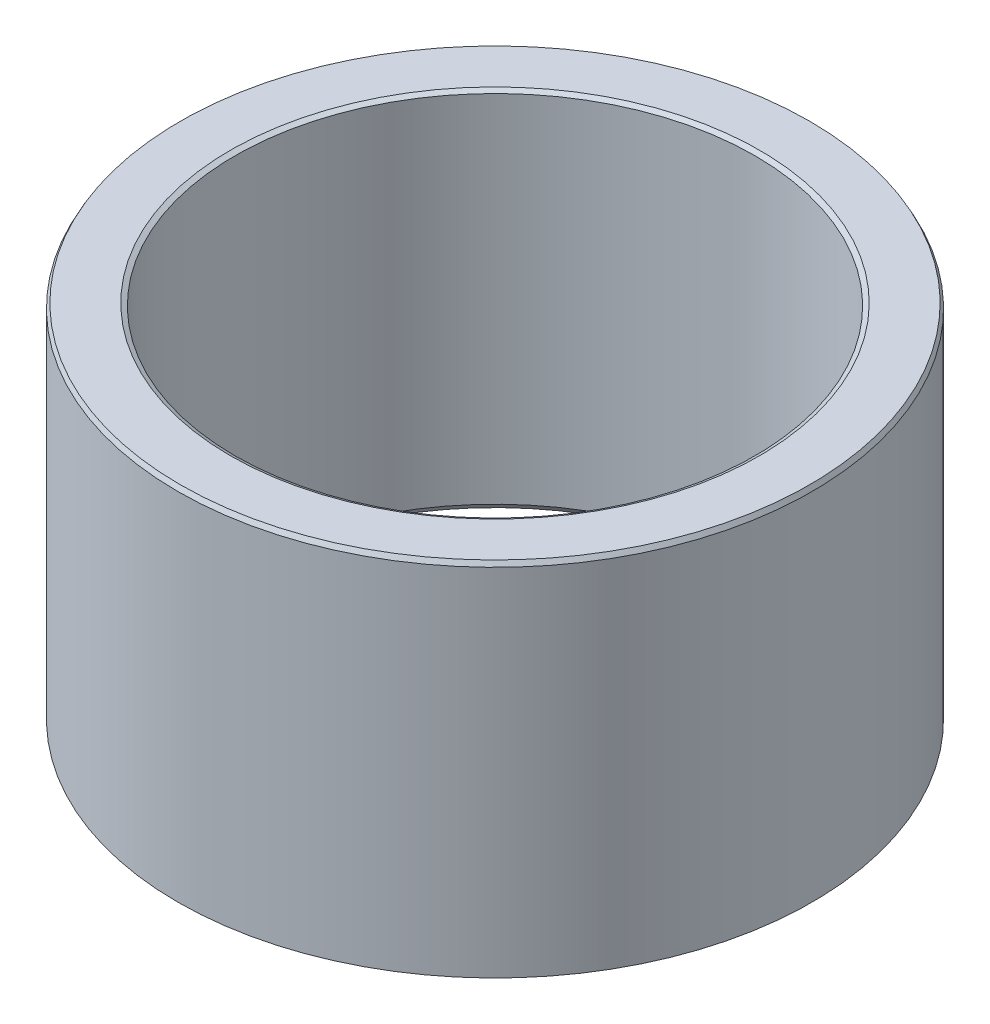
ISO-10303-21;
HEADER;
FILE_DESCRIPTION(('STEP AP214'),'2;1');
FILE_NAME('part.step','',(''),(''),'','','');
FILE_SCHEMA(('AUTOMOTIVE_DESIGN { 1 0 10303 214 1 1 1 1 }'));
ENDSEC;
DATA;
#1=APPLICATION_CONTEXT('core data for automotive mechanical design processes');
#2=APPLICATION_PROTOCOL_DEFINITION('international standard','automotive_design',2000,#1);
#3=PRODUCT_CONTEXT('',#1,'mechanical');
#4=PRODUCT('Part','Part','',(#3));
#5=PRODUCT_RELATED_PRODUCT_CATEGORY('part','',(#4));
#6=PRODUCT_DEFINITION_FORMATION('','',#4);
#7=PRODUCT_DEFINITION_CONTEXT('part definition',#1,'design');
#8=PRODUCT_DEFINITION('design','',#6,#7);
#9=PRODUCT_DEFINITION_SHAPE('','',#8);
#10=(LENGTH_UNIT() NAMED_UNIT(*) SI_UNIT(.MILLI.,.METRE.));
#11=(NAMED_UNIT(*) PLANE_ANGLE_UNIT() SI_UNIT($,.RADIAN.));
#12=(NAMED_UNIT(*) SI_UNIT($,.STERADIAN.) SOLID_ANGLE_UNIT());
#13=UNCERTAINTY_MEASURE_WITH_UNIT(LENGTH_MEASURE(1.E-05),#10,'distance_accuracy_value','');
#14=(GEOMETRIC_REPRESENTATION_CONTEXT(3) GLOBAL_UNCERTAINTY_ASSIGNED_CONTEXT((#13)) GLOBAL_UNIT_ASSIGNED_CONTEXT((#10,
#11,#12)) REPRESENTATION_CONTEXT('',''));
#15=CARTESIAN_POINT('',(0.,0.,0.));
#16=DIRECTION('',(0.,0.,1.));
#17=DIRECTION('',(1.,0.,0.));
#18=AXIS2_PLACEMENT_3D('',#15,#16,#17);
#19=CARTESIAN_POINT('',(0.,40.0247084313328,0.));
#20=DIRECTION('',(0.,-1.,0.));
#21=DIRECTION('',(0.,0.,-1.));
#22=AXIS2_PLACEMENT_3D('',#19,#20,#21);
#23=CYLINDRICAL_SURFACE('',#22,35.);
#24=CARTESIAN_POINT('',(0.,0.266962145229234,0.));
#25=DIRECTION('',(0.,1.,0.));
#26=DIRECTION('',(0.,0.,1.));
#27=AXIS2_PLACEMENT_3D('',#24,#25,#26);
#28=CIRCLE('',#27,35.);
#29=CARTESIAN_POINT('',(0.,0.266962145229234,35.));
#30=VERTEX_POINT('',#29);
#31=EDGE_CURVE('E10',#30,#30,#28,.T.);
#32=ORIENTED_EDGE('',*,*,#31,.T.);
#33=EDGE_LOOP('',(#32));
#34=FACE_BOUND('',#33,.T.);
#35=CARTESIAN_POINT('',(0.,39.5119294516026,0.));
#36=DIRECTION('',(0.,1.,0.));
#37=DIRECTION('',(0.,0.,1.));
#38=AXIS2_PLACEMENT_3D('',#35,#36,#37);
#39=CIRCLE('',#38,35.);
#40=CARTESIAN_POINT('',(0.,39.5119294516026,35.));
#41=VERTEX_POINT('',#40);
#42=EDGE_CURVE('E50',#41,#41,#39,.F.);
#43=ORIENTED_EDGE('',*,*,#42,.T.);
#44=EDGE_LOOP('',(#43));
#45=FACE_BOUND('',#44,.T.);
#46=ADVANCED_FACE('F39',(#34,#45),#23,.T.);
#47=CARTESIAN_POINT('',(0.,40.0247084313328,0.));
#48=DIRECTION('',(0.,1.,0.));
#49=DIRECTION('',(0.,0.,1.));
#50=AXIS2_PLACEMENT_3D('',#47,#48,#49);
#51=PLANE('',#50);
#52=CARTESIAN_POINT('',(0.,40.0247084313328,0.));
#53=DIRECTION('',(0.,1.,0.));
#54=DIRECTION('',(0.,0.,1.));
#55=AXIS2_PLACEMENT_3D('',#52,#53,#54);
#56=CIRCLE('',#55,29.1983333612217);
#57=CARTESIAN_POINT('',(0.,40.0247084313328,29.1983333612217));
#58=VERTEX_POINT('',#57);
#59=EDGE_CURVE('E58',#58,#58,#56,.F.);
#60=ORIENTED_EDGE('',*,*,#59,.T.);
#61=EDGE_LOOP('',(#60));
#62=FACE_BOUND('',#61,.T.);
#63=CARTESIAN_POINT('',(0.,40.0247084313328,0.));
#64=DIRECTION('',(0.,1.,0.));
#65=DIRECTION('',(0.,0.,1.));
#66=AXIS2_PLACEMENT_3D('',#63,#64,#65);
#67=CIRCLE('',#66,34.7330378547708);
#68=CARTESIAN_POINT('',(0.,40.0247084313328,34.7330378547708));
#69=VERTEX_POINT('',#68);
#70=EDGE_CURVE('E61',#69,#69,#67,.T.);
#71=ORIENTED_EDGE('',*,*,#70,.T.);
#72=EDGE_LOOP('',(#71));
#73=FACE_BOUND('',#72,.T.);
#74=ADVANCED_FACE('F88',(#62,#73),#51,.T.);
#75=CARTESIAN_POINT('',(0.,0.,0.));
#76=DIRECTION('',(0.,1.,0.));
#77=DIRECTION('',(0.,0.,1.));
#78=AXIS2_PLACEMENT_3D('',#75,#76,#77);
#79=PLANE('',#78);
#80=CARTESIAN_POINT('',(0.,0.,0.));
#81=DIRECTION('',(0.,1.,0.));
#82=DIRECTION('',(0.,0.,1.));
#83=AXIS2_PLACEMENT_3D('',#80,#81,#82);
#84=CIRCLE('',#83,28.9525165267208);
#85=CARTESIAN_POINT('',(0.,0.,28.9525165267208));
#86=VERTEX_POINT('',#85);
#87=EDGE_CURVE('E51',#86,#86,#84,.T.);
#88=ORIENTED_EDGE('',*,*,#87,.T.);
#89=EDGE_LOOP('',(#88));
#90=FACE_BOUND('',#89,.T.);
#91=CARTESIAN_POINT('',(0.,0.,0.));
#92=DIRECTION('',(0.,1.,0.));
#93=DIRECTION('',(0.,0.,1.));
#94=AXIS2_PLACEMENT_3D('',#91,#92,#93);
#95=CIRCLE('',#94,34.4872210202699);
#96=CARTESIAN_POINT('',(0.,0.,34.4872210202699));
#97=VERTEX_POINT('',#96);
#98=EDGE_CURVE('E54',#97,#97,#95,.F.);
#99=ORIENTED_EDGE('',*,*,#98,.T.);
#100=EDGE_LOOP('',(#99));
#101=FACE_BOUND('',#100,.T.);
#102=ADVANCED_FACE('F83',(#90,#101),#79,.F.);
#103=CARTESIAN_POINT('',(0.,40.0247084313328,0.));
#104=DIRECTION('',(0.,-1.,0.));
#105=DIRECTION('',(0.,0.,-1.));
#106=AXIS2_PLACEMENT_3D('',#103,#104,#105);
#107=CYLINDRICAL_SURFACE('',#106,28.6855543814916);
#108=CARTESIAN_POINT('',(0.,39.7577462861036,0.));
#109=DIRECTION('',(0.,1.,0.));
#110=DIRECTION('',(0.,0.,1.));
#111=AXIS2_PLACEMENT_3D('',#108,#109,#110);
#112=CIRCLE('',#111,28.6855543814916);
#113=CARTESIAN_POINT('',(0.,39.7577462861036,28.6855543814916));
#114=VERTEX_POINT('',#113);
#115=EDGE_CURVE('E67',#114,#114,#112,.T.);
#116=ORIENTED_EDGE('',*,*,#115,.T.);
#117=EDGE_LOOP('',(#116));
#118=FACE_BOUND('',#117,.T.);
#119=CARTESIAN_POINT('',(0.,0.51277897973015,0.));
#120=DIRECTION('',(0.,1.,0.));
#121=DIRECTION('',(0.,0.,1.));
#122=AXIS2_PLACEMENT_3D('',#119,#120,#121);
#123=CIRCLE('',#122,28.6855543814916);
#124=CARTESIAN_POINT('',(0.,0.51277897973015,28.6855543814916));
#125=VERTEX_POINT('',#124);
#126=EDGE_CURVE('E69',#125,#125,#123,.F.);
#127=ORIENTED_EDGE('',*,*,#126,.T.);
#128=EDGE_LOOP('',(#127));
#129=FACE_BOUND('',#128,.T.);
#130=ADVANCED_FACE('F71',(#118,#129),#107,.F.);
#131=CARTESIAN_POINT('',(0.,39.7577462861036,0.));
#132=DIRECTION('',(0.,1.,0.));
#133=DIRECTION('',(0.,0.,1.));
#134=AXIS2_PLACEMENT_3D('',#131,#132,#133);
#135=CONICAL_SURFACE('',#134,28.6855543814916,1.09079042325002);
#136=ORIENTED_EDGE('',*,*,#59,.F.);
#137=EDGE_LOOP('',(#136));
#138=FACE_BOUND('',#137,.T.);
#139=ORIENTED_EDGE('',*,*,#115,.F.);
#140=EDGE_LOOP('',(#139));
#141=FACE_BOUND('',#140,.T.);
#142=ADVANCED_FACE('F77',(#138,#141),#135,.F.);
#143=CARTESIAN_POINT('',(0.,0.,0.));
#144=DIRECTION('',(0.,-1.,0.));
#145=DIRECTION('',(0.,0.,-1.));
#146=AXIS2_PLACEMENT_3D('',#143,#144,#145);
#147=CONICAL_SURFACE('',#146,28.9525165267208,0.480005903544887);
#148=ORIENTED_EDGE('',*,*,#126,.F.);
#149=EDGE_LOOP('',(#148));
#150=FACE_BOUND('',#149,.T.);
#151=ORIENTED_EDGE('',*,*,#87,.F.);
#152=EDGE_LOOP('',(#151));
#153=FACE_BOUND('',#152,.T.);
#154=ADVANCED_FACE('F73',(#150,#153),#147,.F.);
#155=CARTESIAN_POINT('',(0.,0.266962145229234,0.));
#156=DIRECTION('',(0.,1.,0.));
#157=DIRECTION('',(0.,0.,1.));
#158=AXIS2_PLACEMENT_3D('',#155,#156,#157);
#159=CONICAL_SURFACE('',#158,35.,1.09079042325);
#160=ORIENTED_EDGE('',*,*,#98,.F.);
#161=EDGE_LOOP('',(#160));
#162=FACE_BOUND('',#161,.T.);
#163=ORIENTED_EDGE('',*,*,#31,.F.);
#164=EDGE_LOOP('',(#163));
#165=FACE_BOUND('',#164,.T.);
#166=ADVANCED_FACE('F76',(#162,#165),#159,.T.);
#167=CARTESIAN_POINT('',(0.,40.0247084313328,0.));
#168=DIRECTION('',(0.,-1.,0.));
#169=DIRECTION('',(0.,0.,-1.));
#170=AXIS2_PLACEMENT_3D('',#167,#168,#169);
#171=CONICAL_SURFACE('',#170,34.7330378547708,0.480005903544887);
#172=ORIENTED_EDGE('',*,*,#42,.F.);
#173=EDGE_LOOP('',(#172));
#174=FACE_BOUND('',#173,.T.);
#175=ORIENTED_EDGE('',*,*,#70,.F.);
#176=EDGE_LOOP('',(#175));
#177=FACE_BOUND('',#176,.T.);
#178=ADVANCED_FACE('F45',(#174,#177),#171,.T.);
#179=CLOSED_SHELL('',(#46,#74,#102,#130,#142,#154,#166,#178));
#180=MANIFOLD_SOLID_BREP('B2',#179);
#181=ADVANCED_BREP_SHAPE_REPRESENTATION('',(#18,#180),#14);
#182=SHAPE_DEFINITION_REPRESENTATION(#9,#181);
ENDSEC;
END-ISO-10303-21;
